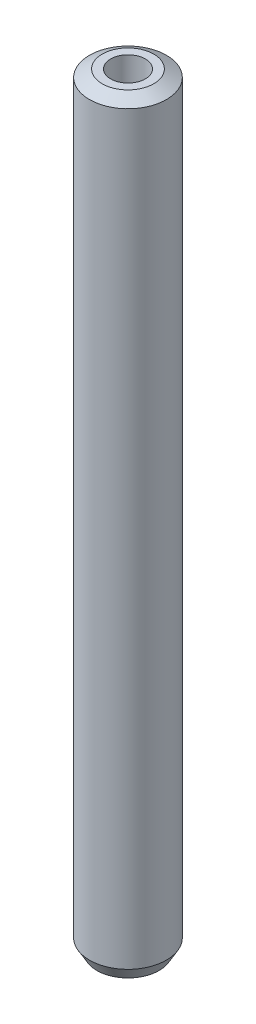
ISO-10303-21;
HEADER;
FILE_DESCRIPTION(('STEP AP214'),'2;1');
FILE_NAME('part.step','',(''),(''),'','','');
FILE_SCHEMA(('AUTOMOTIVE_DESIGN { 1 0 10303 214 1 1 1 1 }'));
ENDSEC;
DATA;
#1=APPLICATION_CONTEXT('core data for automotive mechanical design processes');
#2=APPLICATION_PROTOCOL_DEFINITION('international standard','automotive_design',2000,#1);
#3=PRODUCT_CONTEXT('',#1,'mechanical');
#4=PRODUCT('Part','Part','',(#3));
#5=PRODUCT_RELATED_PRODUCT_CATEGORY('part','',(#4));
#6=PRODUCT_DEFINITION_FORMATION('','',#4);
#7=PRODUCT_DEFINITION_CONTEXT('part definition',#1,'design');
#8=PRODUCT_DEFINITION('design','',#6,#7);
#9=PRODUCT_DEFINITION_SHAPE('','',#8);
#10=(LENGTH_UNIT() NAMED_UNIT(*) SI_UNIT(.MILLI.,.METRE.));
#11=(NAMED_UNIT(*) PLANE_ANGLE_UNIT() SI_UNIT($,.RADIAN.));
#12=(NAMED_UNIT(*) SI_UNIT($,.STERADIAN.) SOLID_ANGLE_UNIT());
#13=UNCERTAINTY_MEASURE_WITH_UNIT(LENGTH_MEASURE(1.E-05),#10,'distance_accuracy_value','');
#14=(GEOMETRIC_REPRESENTATION_CONTEXT(3) GLOBAL_UNCERTAINTY_ASSIGNED_CONTEXT((#13)) GLOBAL_UNIT_ASSIGNED_CONTEXT((#10,
#11,#12)) REPRESENTATION_CONTEXT('',''));
#15=CARTESIAN_POINT('',(0.,0.,0.));
#16=DIRECTION('',(0.,0.,1.));
#17=DIRECTION('',(1.,0.,0.));
#18=AXIS2_PLACEMENT_3D('',#15,#16,#17);
#19=CARTESIAN_POINT('',(0.,199.033229490979,0.));
#20=DIRECTION('',(0.,-1.,0.));
#21=DIRECTION('',(0.,0.,-1.));
#22=AXIS2_PLACEMENT_3D('',#19,#20,#21);
#23=CYLINDRICAL_SURFACE('',#22,10.);
#24=CARTESIAN_POINT('',(0.,197.126839861241,0.));
#25=DIRECTION('',(0.,1.,0.));
#26=DIRECTION('',(0.,0.,1.));
#27=AXIS2_PLACEMENT_3D('',#24,#25,#26);
#28=CIRCLE('',#27,10.);
#29=CARTESIAN_POINT('',(0.,197.126839861241,10.));
#30=VERTEX_POINT('',#29);
#31=EDGE_CURVE('E50',#30,#30,#28,.F.);
#32=ORIENTED_EDGE('',*,*,#31,.T.);
#33=EDGE_LOOP('',(#32));
#34=FACE_BOUND('',#33,.T.);
#35=CARTESIAN_POINT('',(0.,3.30196369772798,0.));
#36=DIRECTION('',(0.,1.,0.));
#37=DIRECTION('',(0.,0.,1.));
#38=AXIS2_PLACEMENT_3D('',#35,#36,#37);
#39=CIRCLE('',#38,10.);
#40=CARTESIAN_POINT('',(0.,3.30196369772798,10.));
#41=VERTEX_POINT('',#40);
#42=EDGE_CURVE('E51',#41,#41,#39,.T.);
#43=ORIENTED_EDGE('',*,*,#42,.T.);
#44=EDGE_LOOP('',(#43));
#45=FACE_BOUND('',#44,.T.);
#46=ADVANCED_FACE('F39',(#34,#45),#23,.T.);
#47=CARTESIAN_POINT('',(0.,199.033229490979,0.));
#48=DIRECTION('',(0.,1.,0.));
#49=DIRECTION('',(0.,0.,1.));
#50=AXIS2_PLACEMENT_3D('',#47,#48,#49);
#51=PLANE('',#50);
#52=CARTESIAN_POINT('',(0.,199.033229490979,0.));
#53=DIRECTION('',(0.,1.,0.));
#54=DIRECTION('',(0.,0.,1.));
#55=AXIS2_PLACEMENT_3D('',#52,#53,#54);
#56=CIRCLE('',#55,6.69803630227184);
#57=CARTESIAN_POINT('',(0.,199.033229490979,6.69803630227184));
#58=VERTEX_POINT('',#57);
#59=EDGE_CURVE('E54',#58,#58,#56,.T.);
#60=ORIENTED_EDGE('',*,*,#59,.T.);
#61=EDGE_LOOP('',(#60));
#62=FACE_BOUND('',#61,.T.);
#63=CARTESIAN_POINT('',(0.,199.033229490979,0.));
#64=DIRECTION('',(0.,1.,0.));
#65=DIRECTION('',(0.,0.,1.));
#66=AXIS2_PLACEMENT_3D('',#63,#64,#65);
#67=CIRCLE('',#66,4.50753553624);
#68=CARTESIAN_POINT('',(0.,199.033229490979,4.50753553624));
#69=VERTEX_POINT('',#68);
#70=EDGE_CURVE('E58',#69,#69,#67,.T.);
#71=ORIENTED_EDGE('',*,*,#70,.F.);
#72=EDGE_LOOP('',(#71));
#73=FACE_BOUND('',#72,.T.);
#74=ADVANCED_FACE('F69',(#62,#73),#51,.T.);
#75=CARTESIAN_POINT('',(0.,0.,0.));
#76=DIRECTION('',(0.,1.,0.));
#77=DIRECTION('',(0.,0.,1.));
#78=AXIS2_PLACEMENT_3D('',#75,#76,#77);
#79=PLANE('',#78);
#80=CARTESIAN_POINT('',(0.,0.,0.));
#81=DIRECTION('',(0.,1.,0.));
#82=DIRECTION('',(0.,0.,1.));
#83=AXIS2_PLACEMENT_3D('',#80,#81,#82);
#84=CIRCLE('',#83,8.09361037026236);
#85=CARTESIAN_POINT('',(0.,0.,8.09361037026236));
#86=VERTEX_POINT('',#85);
#87=EDGE_CURVE('E10',#86,#86,#84,.F.);
#88=ORIENTED_EDGE('',*,*,#87,.T.);
#89=EDGE_LOOP('',(#88));
#90=FACE_BOUND('',#89,.T.);
#91=CARTESIAN_POINT('',(0.,0.,0.));
#92=DIRECTION('',(0.,1.,0.));
#93=DIRECTION('',(0.,0.,1.));
#94=AXIS2_PLACEMENT_3D('',#91,#92,#93);
#95=CIRCLE('',#94,4.50753553624);
#96=CARTESIAN_POINT('',(0.,0.,4.50753553624));
#97=VERTEX_POINT('',#96);
#98=EDGE_CURVE('E63',#97,#97,#95,.T.);
#99=ORIENTED_EDGE('',*,*,#98,.T.);
#100=EDGE_LOOP('',(#99));
#101=FACE_BOUND('',#100,.T.);
#102=ADVANCED_FACE('F75',(#90,#101),#79,.F.);
#103=CARTESIAN_POINT('',(0.,199.033229490979,0.));
#104=DIRECTION('',(0.,-1.,0.));
#105=DIRECTION('',(0.,0.,-1.));
#106=AXIS2_PLACEMENT_3D('',#103,#104,#105);
#107=CYLINDRICAL_SURFACE('',#106,4.50753553624);
#108=ORIENTED_EDGE('',*,*,#70,.T.);
#109=EDGE_LOOP('',(#108));
#110=FACE_BOUND('',#109,.T.);
#111=ORIENTED_EDGE('',*,*,#98,.F.);
#112=EDGE_LOOP('',(#111));
#113=FACE_BOUND('',#112,.T.);
#114=ADVANCED_FACE('F70',(#110,#113),#107,.F.);
#115=CARTESIAN_POINT('',(0.,199.033229490979,0.));
#116=DIRECTION('',(0.,-1.,0.));
#117=DIRECTION('',(0.,0.,-1.));
#118=AXIS2_PLACEMENT_3D('',#115,#116,#117);
#119=CONICAL_SURFACE('',#118,6.69803630227184,1.04719755119659);
#120=ORIENTED_EDGE('',*,*,#31,.F.);
#121=EDGE_LOOP('',(#120));
#122=FACE_BOUND('',#121,.T.);
#123=ORIENTED_EDGE('',*,*,#59,.F.);
#124=EDGE_LOOP('',(#123));
#125=FACE_BOUND('',#124,.T.);
#126=ADVANCED_FACE('F81',(#122,#125),#119,.T.);
#127=CARTESIAN_POINT('',(0.,3.30196369772798,0.));
#128=DIRECTION('',(0.,1.,0.));
#129=DIRECTION('',(0.,0.,1.));
#130=AXIS2_PLACEMENT_3D('',#127,#128,#129);
#131=CONICAL_SURFACE('',#130,10.,0.523598775598303);
#132=ORIENTED_EDGE('',*,*,#87,.F.);
#133=EDGE_LOOP('',(#132));
#134=FACE_BOUND('',#133,.T.);
#135=ORIENTED_EDGE('',*,*,#42,.F.);
#136=EDGE_LOOP('',(#135));
#137=FACE_BOUND('',#136,.T.);
#138=ADVANCED_FACE('F45',(#134,#137),#131,.T.);
#139=CLOSED_SHELL('',(#46,#74,#102,#114,#126,#138));
#140=MANIFOLD_SOLID_BREP('B2',#139);
#141=ADVANCED_BREP_SHAPE_REPRESENTATION('',(#18,#140),#14);
#142=SHAPE_DEFINITION_REPRESENTATION(#9,#141);
ENDSEC;
END-ISO-10303-21;
